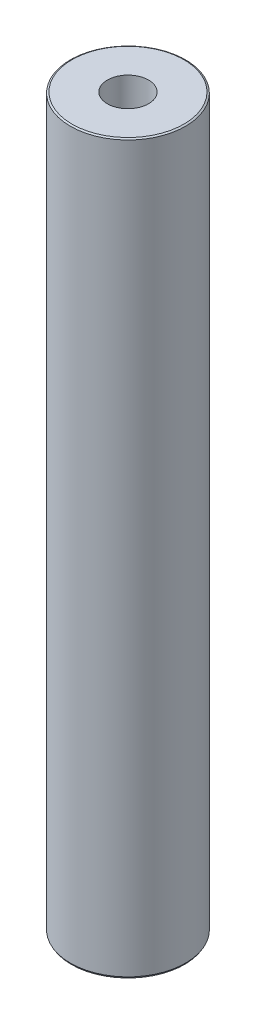
ISO-10303-21;
HEADER;
FILE_DESCRIPTION(('STEP AP214'),'2;1');
FILE_NAME('part.step','',(''),(''),'','','');
FILE_SCHEMA(('AUTOMOTIVE_DESIGN { 1 0 10303 214 1 1 1 1 }'));
ENDSEC;
DATA;
#1=APPLICATION_CONTEXT('core data for automotive mechanical design processes');
#2=APPLICATION_PROTOCOL_DEFINITION('international standard','automotive_design',2000,#1);
#3=PRODUCT_CONTEXT('',#1,'mechanical');
#4=PRODUCT('Part','Part','',(#3));
#5=PRODUCT_RELATED_PRODUCT_CATEGORY('part','',(#4));
#6=PRODUCT_DEFINITION_FORMATION('','',#4);
#7=PRODUCT_DEFINITION_CONTEXT('part definition',#1,'design');
#8=PRODUCT_DEFINITION('design','',#6,#7);
#9=PRODUCT_DEFINITION_SHAPE('','',#8);
#10=(LENGTH_UNIT() NAMED_UNIT(*) SI_UNIT(.MILLI.,.METRE.));
#11=(NAMED_UNIT(*) PLANE_ANGLE_UNIT() SI_UNIT($,.RADIAN.));
#12=(NAMED_UNIT(*) SI_UNIT($,.STERADIAN.) SOLID_ANGLE_UNIT());
#13=UNCERTAINTY_MEASURE_WITH_UNIT(LENGTH_MEASURE(1.E-05),#10,'distance_accuracy_value','');
#14=(GEOMETRIC_REPRESENTATION_CONTEXT(3) GLOBAL_UNCERTAINTY_ASSIGNED_CONTEXT((#13)) GLOBAL_UNIT_ASSIGNED_CONTEXT((#10,
#11,#12)) REPRESENTATION_CONTEXT('',''));
#15=CARTESIAN_POINT('',(0.,0.,0.));
#16=DIRECTION('',(0.,0.,1.));
#17=DIRECTION('',(1.,0.,0.));
#18=AXIS2_PLACEMENT_3D('',#15,#16,#17);
#19=CARTESIAN_POINT('',(0.,600.,0.));
#20=DIRECTION('',(0.,-1.,0.));
#21=DIRECTION('',(0.,0.,-1.));
#22=AXIS2_PLACEMENT_3D('',#19,#20,#21);
#23=CYLINDRICAL_SURFACE('',#22,47.5);
#24=CARTESIAN_POINT('',(0.,599.203671191939,0.));
#25=DIRECTION('',(0.,1.,0.));
#26=DIRECTION('',(0.,0.,1.));
#27=AXIS2_PLACEMENT_3D('',#24,#25,#26);
#28=CIRCLE('',#27,47.5);
#29=CARTESIAN_POINT('',(0.,599.203671191939,47.5));
#30=VERTEX_POINT('',#29);
#31=EDGE_CURVE('E50',#30,#30,#28,.F.);
#32=ORIENTED_EDGE('',*,*,#31,.T.);
#33=EDGE_LOOP('',(#32));
#34=FACE_BOUND('',#33,.T.);
#35=CARTESIAN_POINT('',(0.,1.37928195509252,0.));
#36=DIRECTION('',(0.,1.,0.));
#37=DIRECTION('',(0.,0.,1.));
#38=AXIS2_PLACEMENT_3D('',#35,#36,#37);
#39=CIRCLE('',#38,47.5);
#40=CARTESIAN_POINT('',(0.,1.37928195509252,47.5));
#41=VERTEX_POINT('',#40);
#42=EDGE_CURVE('E51',#41,#41,#39,.T.);
#43=ORIENTED_EDGE('',*,*,#42,.T.);
#44=EDGE_LOOP('',(#43));
#45=FACE_BOUND('',#44,.T.);
#46=ADVANCED_FACE('F39',(#34,#45),#23,.T.);
#47=CARTESIAN_POINT('',(0.,600.,0.));
#48=DIRECTION('',(0.,1.,0.));
#49=DIRECTION('',(0.,0.,1.));
#50=AXIS2_PLACEMENT_3D('',#47,#48,#49);
#51=PLANE('',#50);
#52=CARTESIAN_POINT('',(0.,600.,0.));
#53=DIRECTION('',(0.,1.,0.));
#54=DIRECTION('',(0.,0.,1.));
#55=AXIS2_PLACEMENT_3D('',#52,#53,#54);
#56=CIRCLE('',#55,46.1207180449071);
#57=CARTESIAN_POINT('',(0.,600.,46.1207180449071));
#58=VERTEX_POINT('',#57);
#59=EDGE_CURVE('E54',#58,#58,#56,.T.);
#60=ORIENTED_EDGE('',*,*,#59,.T.);
#61=EDGE_LOOP('',(#60));
#62=FACE_BOUND('',#61,.T.);
#63=CARTESIAN_POINT('',(0.,600.,0.));
#64=DIRECTION('',(0.,1.,0.));
#65=DIRECTION('',(0.,0.,1.));
#66=AXIS2_PLACEMENT_3D('',#63,#64,#65);
#67=CIRCLE('',#66,17.0099615646822);
#68=CARTESIAN_POINT('',(0.,600.,17.0099615646822));
#69=VERTEX_POINT('',#68);
#70=EDGE_CURVE('E58',#69,#69,#67,.T.);
#71=ORIENTED_EDGE('',*,*,#70,.F.);
#72=EDGE_LOOP('',(#71));
#73=FACE_BOUND('',#72,.T.);
#74=ADVANCED_FACE('F69',(#62,#73),#51,.T.);
#75=CARTESIAN_POINT('',(0.,0.,0.));
#76=DIRECTION('',(0.,1.,0.));
#77=DIRECTION('',(0.,0.,1.));
#78=AXIS2_PLACEMENT_3D('',#75,#76,#77);
#79=PLANE('',#78);
#80=CARTESIAN_POINT('',(0.,0.,0.));
#81=DIRECTION('',(0.,1.,0.));
#82=DIRECTION('',(0.,0.,1.));
#83=AXIS2_PLACEMENT_3D('',#80,#81,#82);
#84=CIRCLE('',#83,46.7036711919389);
#85=CARTESIAN_POINT('',(0.,0.,46.7036711919389));
#86=VERTEX_POINT('',#85);
#87=EDGE_CURVE('E10',#86,#86,#84,.F.);
#88=ORIENTED_EDGE('',*,*,#87,.T.);
#89=EDGE_LOOP('',(#88));
#90=FACE_BOUND('',#89,.T.);
#91=CARTESIAN_POINT('',(0.,0.,0.));
#92=DIRECTION('',(0.,1.,0.));
#93=DIRECTION('',(0.,0.,1.));
#94=AXIS2_PLACEMENT_3D('',#91,#92,#93);
#95=CIRCLE('',#94,17.0099615646822);
#96=CARTESIAN_POINT('',(0.,0.,17.0099615646822));
#97=VERTEX_POINT('',#96);
#98=EDGE_CURVE('E63',#97,#97,#95,.T.);
#99=ORIENTED_EDGE('',*,*,#98,.T.);
#100=EDGE_LOOP('',(#99));
#101=FACE_BOUND('',#100,.T.);
#102=ADVANCED_FACE('F75',(#90,#101),#79,.F.);
#103=CARTESIAN_POINT('',(0.,600.,0.));
#104=DIRECTION('',(0.,-1.,0.));
#105=DIRECTION('',(0.,0.,-1.));
#106=AXIS2_PLACEMENT_3D('',#103,#104,#105);
#107=CYLINDRICAL_SURFACE('',#106,17.0099615646822);
#108=ORIENTED_EDGE('',*,*,#70,.T.);
#109=EDGE_LOOP('',(#108));
#110=FACE_BOUND('',#109,.T.);
#111=ORIENTED_EDGE('',*,*,#98,.F.);
#112=EDGE_LOOP('',(#111));
#113=FACE_BOUND('',#112,.T.);
#114=ADVANCED_FACE('F70',(#110,#113),#107,.F.);
#115=CARTESIAN_POINT('',(0.,600.,0.));
#116=DIRECTION('',(0.,-1.,0.));
#117=DIRECTION('',(0.,0.,-1.));
#118=AXIS2_PLACEMENT_3D('',#115,#116,#117);
#119=CONICAL_SURFACE('',#118,46.1207180449071,1.04719755119661);
#120=ORIENTED_EDGE('',*,*,#31,.F.);
#121=EDGE_LOOP('',(#120));
#122=FACE_BOUND('',#121,.T.);
#123=ORIENTED_EDGE('',*,*,#59,.F.);
#124=EDGE_LOOP('',(#123));
#125=FACE_BOUND('',#124,.T.);
#126=ADVANCED_FACE('F81',(#122,#125),#119,.T.);
#127=CARTESIAN_POINT('',(0.,1.37928195509252,0.));
#128=DIRECTION('',(0.,1.,0.));
#129=DIRECTION('',(0.,0.,1.));
#130=AXIS2_PLACEMENT_3D('',#127,#128,#129);
#131=CONICAL_SURFACE('',#130,47.5,0.52359877559832);
#132=ORIENTED_EDGE('',*,*,#87,.F.);
#133=EDGE_LOOP('',(#132));
#134=FACE_BOUND('',#133,.T.);
#135=ORIENTED_EDGE('',*,*,#42,.F.);
#136=EDGE_LOOP('',(#135));
#137=FACE_BOUND('',#136,.T.);
#138=ADVANCED_FACE('F45',(#134,#137),#131,.T.);
#139=CLOSED_SHELL('',(#46,#74,#102,#114,#126,#138));
#140=MANIFOLD_SOLID_BREP('B2',#139);
#141=ADVANCED_BREP_SHAPE_REPRESENTATION('',(#18,#140),#14);
#142=SHAPE_DEFINITION_REPRESENTATION(#9,#141);
ENDSEC;
END-ISO-10303-21;
